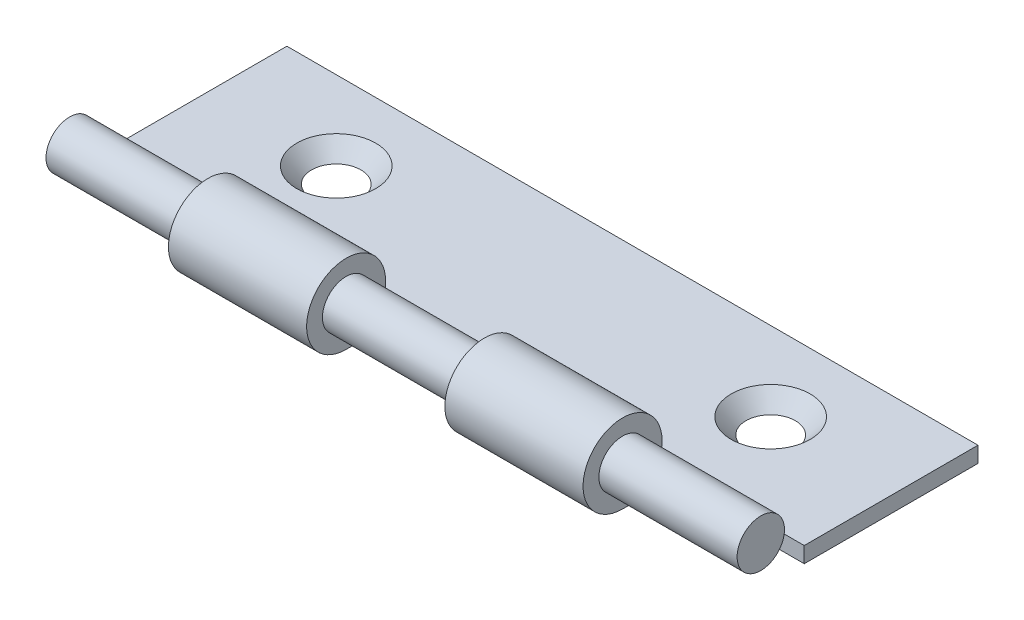
ISO-10303-21;
HEADER;
FILE_DESCRIPTION(('STEP AP214'),'2;1');
FILE_NAME('part.step','',(''),(''),'','','');
FILE_SCHEMA(('AUTOMOTIVE_DESIGN { 1 0 10303 214 1 1 1 1 }'));
ENDSEC;
DATA;
#1=APPLICATION_CONTEXT('core data for automotive mechanical design processes');
#2=APPLICATION_PROTOCOL_DEFINITION('international standard','automotive_design',2000,#1);
#3=PRODUCT_CONTEXT('',#1,'mechanical');
#4=PRODUCT('Part','Part','',(#3));
#5=PRODUCT_RELATED_PRODUCT_CATEGORY('part','',(#4));
#6=PRODUCT_DEFINITION_FORMATION('','',#4);
#7=PRODUCT_DEFINITION_CONTEXT('part definition',#1,'design');
#8=PRODUCT_DEFINITION('design','',#6,#7);
#9=PRODUCT_DEFINITION_SHAPE('','',#8);
#10=(LENGTH_UNIT() NAMED_UNIT(*) SI_UNIT(.MILLI.,.METRE.));
#11=(NAMED_UNIT(*) PLANE_ANGLE_UNIT() SI_UNIT($,.RADIAN.));
#12=(NAMED_UNIT(*) SI_UNIT($,.STERADIAN.) SOLID_ANGLE_UNIT());
#13=UNCERTAINTY_MEASURE_WITH_UNIT(LENGTH_MEASURE(1.E-05),#10,'distance_accuracy_value','');
#14=(GEOMETRIC_REPRESENTATION_CONTEXT(3) GLOBAL_UNCERTAINTY_ASSIGNED_CONTEXT((#13)) GLOBAL_UNIT_ASSIGNED_CONTEXT((#10,
#11,#12)) REPRESENTATION_CONTEXT('',''));
#15=CARTESIAN_POINT('',(0.,0.,0.));
#16=DIRECTION('',(0.,0.,1.));
#17=DIRECTION('',(1.,0.,0.));
#18=AXIS2_PLACEMENT_3D('',#15,#16,#17);
#19=CARTESIAN_POINT('',(35.,0.,0.));
#20=DIRECTION('',(-1.,0.,0.));
#21=DIRECTION('',(0.,0.,1.));
#22=AXIS2_PLACEMENT_3D('',#19,#20,#21);
#23=CYLINDRICAL_SURFACE('',#22,2.);
#24=CARTESIAN_POINT('',(28.,0.,0.));
#25=DIRECTION('',(-1.,0.,0.));
#26=DIRECTION('',(0.,0.,1.));
#27=AXIS2_PLACEMENT_3D('',#24,#25,#26);
#28=CIRCLE('',#27,2.);
#29=CARTESIAN_POINT('',(28.,-2.,0.));
#30=VERTEX_POINT('',#29);
#31=CARTESIAN_POINT('',(28.,-0.969619240492674,-1.74923941427879));
#32=VERTEX_POINT('',#31);
#33=EDGE_CURVE('E10',#30,#32,#28,.T.);
#34=ORIENTED_EDGE('',*,*,#33,.T.);
#35=DIRECTION('',(-1.,0.,0.));
#36=VECTOR('',#35,1.);
#37=CARTESIAN_POINT('',(35.,-0.969619240492674,-1.74923941427879));
#38=LINE('',#37,#36);
#39=CARTESIAN_POINT('',(21.,-0.969619240492674,-1.74923941427879));
#40=VERTEX_POINT('',#39);
#41=EDGE_CURVE('E296',#32,#40,#38,.T.);
#42=ORIENTED_EDGE('',*,*,#41,.T.);
#43=CARTESIAN_POINT('',(21.,0.,0.));
#44=DIRECTION('',(1.,0.,0.));
#45=DIRECTION('',(0.,0.,-1.));
#46=AXIS2_PLACEMENT_3D('',#43,#44,#45);
#47=CIRCLE('',#46,2.);
#48=CARTESIAN_POINT('',(21.,-2.,0.));
#49=VERTEX_POINT('',#48);
#50=EDGE_CURVE('E227',#40,#49,#47,.T.);
#51=ORIENTED_EDGE('',*,*,#50,.T.);
#52=DIRECTION('',(-1.,0.,0.));
#53=VECTOR('',#52,1.);
#54=CARTESIAN_POINT('',(35.,-2.,0.));
#55=LINE('',#54,#53);
#56=EDGE_CURVE('E177',#30,#49,#55,.T.);
#57=ORIENTED_EDGE('',*,*,#56,.F.);
#58=EDGE_LOOP('',(#34,#42,#51,#57));
#59=FACE_BOUND('',#58,.T.);
#60=ADVANCED_FACE('F15',(#59),#23,.T.);
#61=CARTESIAN_POINT('',(14.,0.,0.));
#62=DIRECTION('',(-1.,0.,0.));
#63=DIRECTION('',(0.,0.,1.));
#64=AXIS2_PLACEMENT_3D('',#61,#62,#63);
#65=CIRCLE('',#64,2.);
#66=CARTESIAN_POINT('',(14.,-2.,0.));
#67=VERTEX_POINT('',#66);
#68=CARTESIAN_POINT('',(14.,-0.969619240492674,-1.74923941427879));
#69=VERTEX_POINT('',#68);
#70=EDGE_CURVE('E214',#67,#69,#65,.T.);
#71=ORIENTED_EDGE('',*,*,#70,.T.);
#72=CARTESIAN_POINT('',(7.,-0.969619240492674,-1.74923941427879));
#73=VERTEX_POINT('',#72);
#74=EDGE_CURVE('E295',#69,#73,#38,.T.);
#75=ORIENTED_EDGE('',*,*,#74,.T.);
#76=CARTESIAN_POINT('',(7.,0.,0.));
#77=DIRECTION('',(1.,0.,0.));
#78=DIRECTION('',(0.,0.,-1.));
#79=AXIS2_PLACEMENT_3D('',#76,#77,#78);
#80=CIRCLE('',#79,2.);
#81=CARTESIAN_POINT('',(7.,-2.,0.));
#82=VERTEX_POINT('',#81);
#83=EDGE_CURVE('E254',#73,#82,#80,.T.);
#84=ORIENTED_EDGE('',*,*,#83,.T.);
#85=EDGE_CURVE('E176',#67,#82,#55,.T.);
#86=ORIENTED_EDGE('',*,*,#85,.F.);
#87=EDGE_LOOP('',(#71,#75,#84,#86));
#88=FACE_BOUND('',#87,.T.);
#89=ADVANCED_FACE('F308',(#88),#23,.T.);
#90=CARTESIAN_POINT('',(35.,-0.581771544295604,-1.04954364856727));
#91=DIRECTION('',(0.,0.874619707139396,-0.484809620246337));
#92=DIRECTION('',(0.,0.484809620246337,0.874619707139396));
#93=AXIS2_PLACEMENT_3D('',#90,#91,#92);
#94=PLANE('',#93);
#95=ORIENTED_EDGE('',*,*,#41,.F.);
#96=DIRECTION('',(0.,0.484809620246337,0.874619707139396));
#97=VECTOR('',#96,1.);
#98=CARTESIAN_POINT('',(28.,-0.581771544295604,-1.04954364856727));
#99=LINE('',#98,#97);
#100=CARTESIAN_POINT('',(28.,-0.581771544295604,-1.04954364856727));
#101=VERTEX_POINT('',#100);
#102=EDGE_CURVE('E141',#32,#101,#99,.T.);
#103=ORIENTED_EDGE('',*,*,#102,.T.);
#104=DIRECTION('',(-1.,0.,0.));
#105=VECTOR('',#104,1.);
#106=CARTESIAN_POINT('',(35.,-0.581771544295604,-1.04954364856727));
#107=LINE('',#106,#105);
#108=CARTESIAN_POINT('',(21.,-0.581771544295604,-1.04954364856727));
#109=VERTEX_POINT('',#108);
#110=EDGE_CURVE('E135',#101,#109,#107,.T.);
#111=ORIENTED_EDGE('',*,*,#110,.T.);
#112=DIRECTION('',(0.,-0.484809620246337,-0.874619707139396));
#113=VECTOR('',#112,1.);
#114=CARTESIAN_POINT('',(21.,-0.581771544295604,-1.04954364856727));
#115=LINE('',#114,#113);
#116=EDGE_CURVE('E188',#109,#40,#115,.T.);
#117=ORIENTED_EDGE('',*,*,#116,.T.);
#118=EDGE_LOOP('',(#95,#103,#111,#117));
#119=FACE_BOUND('',#118,.T.);
#120=ADVANCED_FACE('F377',(#119),#94,.F.);
#121=CARTESIAN_POINT('',(35.,-2.,0.));
#122=DIRECTION('',(0.,1.,0.));
#123=DIRECTION('',(1.,0.,0.));
#124=AXIS2_PLACEMENT_3D('',#121,#122,#123);
#125=PLANE('',#124);
#126=DIRECTION('',(1.,0.,0.));
#127=VECTOR('',#126,1.);
#128=CARTESIAN_POINT('',(28.,-2.,-2.2));
#129=LINE('',#128,#127);
#130=CARTESIAN_POINT('',(28.,-2.,-2.2));
#131=VERTEX_POINT('',#130);
#132=CARTESIAN_POINT('',(35.,-2.,-2.2));
#133=VERTEX_POINT('',#132);
#134=EDGE_CURVE('E30',#131,#133,#129,.T.);
#135=ORIENTED_EDGE('',*,*,#134,.F.);
#136=DIRECTION('',(0.,0.,-1.));
#137=VECTOR('',#136,1.);
#138=CARTESIAN_POINT('',(28.,-2.,-0.1));
#139=LINE('',#138,#137);
#140=EDGE_CURVE('E341',#30,#131,#139,.T.);
#141=ORIENTED_EDGE('',*,*,#140,.F.);
#142=ORIENTED_EDGE('',*,*,#56,.T.);
#143=DIRECTION('',(0.,0.,1.));
#144=VECTOR('',#143,1.);
#145=CARTESIAN_POINT('',(21.,-2.,-0.1));
#146=LINE('',#145,#144);
#147=CARTESIAN_POINT('',(21.,-2.,-2.2));
#148=VERTEX_POINT('',#147);
#149=EDGE_CURVE('E222',#148,#49,#146,.T.);
#150=ORIENTED_EDGE('',*,*,#149,.F.);
#151=DIRECTION('',(1.,0.,0.));
#152=VECTOR('',#151,1.);
#153=CARTESIAN_POINT('',(14.,-2.,-2.2));
#154=LINE('',#153,#152);
#155=CARTESIAN_POINT('',(14.,-2.,-2.2));
#156=VERTEX_POINT('',#155);
#157=EDGE_CURVE('E211',#156,#148,#154,.T.);
#158=ORIENTED_EDGE('',*,*,#157,.F.);
#159=DIRECTION('',(0.,0.,-1.));
#160=VECTOR('',#159,1.);
#161=CARTESIAN_POINT('',(14.,-2.,-0.1));
#162=LINE('',#161,#160);
#163=EDGE_CURVE('E150',#67,#156,#162,.T.);
#164=ORIENTED_EDGE('',*,*,#163,.F.);
#165=ORIENTED_EDGE('',*,*,#85,.T.);
#166=DIRECTION('',(0.,0.,1.));
#167=VECTOR('',#166,1.);
#168=CARTESIAN_POINT('',(7.,-2.,-0.1));
#169=LINE('',#168,#167);
#170=CARTESIAN_POINT('',(7.,-2.,-2.2));
#171=VERTEX_POINT('',#170);
#172=EDGE_CURVE('E243',#171,#82,#169,.T.);
#173=ORIENTED_EDGE('',*,*,#172,.F.);
#174=DIRECTION('',(1.,0.,0.));
#175=VECTOR('',#174,1.);
#176=CARTESIAN_POINT('',(0.,-2.,-2.2));
#177=LINE('',#176,#175);
#178=CARTESIAN_POINT('',(0.,-2.,-2.2));
#179=VERTEX_POINT('',#178);
#180=EDGE_CURVE('E236',#179,#171,#177,.T.);
#181=ORIENTED_EDGE('',*,*,#180,.F.);
#182=DIRECTION('',(0.,0.,-1.));
#183=VECTOR('',#182,1.);
#184=CARTESIAN_POINT('',(0.,-2.,0.));
#185=LINE('',#184,#183);
#186=CARTESIAN_POINT('',(0.,-2.,-11.));
#187=VERTEX_POINT('',#186);
#188=EDGE_CURVE('E276',#179,#187,#185,.T.);
#189=ORIENTED_EDGE('',*,*,#188,.T.);
#190=DIRECTION('',(-1.,0.,0.));
#191=VECTOR('',#190,1.);
#192=CARTESIAN_POINT('',(35.,-2.,-11.));
#193=LINE('',#192,#191);
#194=CARTESIAN_POINT('',(35.,-2.,-11.));
#195=VERTEX_POINT('',#194);
#196=EDGE_CURVE('E167',#195,#187,#193,.T.);
#197=ORIENTED_EDGE('',*,*,#196,.F.);
#198=DIRECTION('',(0.,0.,-1.));
#199=VECTOR('',#198,1.);
#200=CARTESIAN_POINT('',(35.,-2.,0.));
#201=LINE('',#200,#199);
#202=EDGE_CURVE('E286',#133,#195,#201,.T.);
#203=ORIENTED_EDGE('',*,*,#202,.F.);
#204=EDGE_LOOP('',(#135,#141,#142,#150,#158,#164,#165,#173,#181,#189,#197,#203));
#205=FACE_BOUND('',#204,.T.);
#206=CARTESIAN_POINT('',(6.5,-2.,-7.));
#207=DIRECTION('',(0.,-1.,0.));
#208=DIRECTION('',(1.,0.,0.));
#209=AXIS2_PLACEMENT_3D('',#206,#207,#208);
#210=CIRCLE('',#209,1.25);
#211=CARTESIAN_POINT('',(7.75,-2.,-7.));
#212=VERTEX_POINT('',#211);
#213=EDGE_CURVE('E269',#212,#212,#210,.T.);
#214=ORIENTED_EDGE('',*,*,#213,.F.);
#215=EDGE_LOOP('',(#214));
#216=FACE_BOUND('',#215,.T.);
#217=CARTESIAN_POINT('',(28.5,-2.,-7.));
#218=DIRECTION('',(0.,-1.,0.));
#219=DIRECTION('',(1.,0.,0.));
#220=AXIS2_PLACEMENT_3D('',#217,#218,#219);
#221=CIRCLE('',#220,1.25);
#222=CARTESIAN_POINT('',(29.75,-2.,-7.));
#223=VERTEX_POINT('',#222);
#224=EDGE_CURVE('E261',#223,#223,#221,.T.);
#225=ORIENTED_EDGE('',*,*,#224,.F.);
#226=EDGE_LOOP('',(#225));
#227=FACE_BOUND('',#226,.T.);
#228=ADVANCED_FACE('F329',(#205,#216,#227),#125,.F.);
#229=CARTESIAN_POINT('',(35.,-1.2,0.));
#230=DIRECTION('',(0.,1.,0.));
#231=DIRECTION('',(1.,0.,0.));
#232=AXIS2_PLACEMENT_3D('',#229,#230,#231);
#233=PLANE('',#232);
#234=DIRECTION('',(0.,0.,1.));
#235=VECTOR('',#234,1.);
#236=CARTESIAN_POINT('',(28.,-1.2,0.));
#237=LINE('',#236,#235);
#238=CARTESIAN_POINT('',(28.,-1.2,-2.2));
#239=VERTEX_POINT('',#238);
#240=CARTESIAN_POINT('',(28.,-1.2,0.));
#241=VERTEX_POINT('',#240);
#242=EDGE_CURVE('E140',#239,#241,#237,.T.);
#243=ORIENTED_EDGE('',*,*,#242,.F.);
#244=DIRECTION('',(-1.,0.,0.));
#245=VECTOR('',#244,1.);
#246=CARTESIAN_POINT('',(35.,-1.2,-2.2));
#247=LINE('',#246,#245);
#248=CARTESIAN_POINT('',(35.,-1.2,-2.2));
#249=VERTEX_POINT('',#248);
#250=EDGE_CURVE('E349',#249,#239,#247,.T.);
#251=ORIENTED_EDGE('',*,*,#250,.F.);
#252=DIRECTION('',(0.,0.,-1.));
#253=VECTOR('',#252,1.);
#254=CARTESIAN_POINT('',(35.,-1.2,0.));
#255=LINE('',#254,#253);
#256=CARTESIAN_POINT('',(35.,-1.2,-11.));
#257=VERTEX_POINT('',#256);
#258=EDGE_CURVE('E293',#249,#257,#255,.T.);
#259=ORIENTED_EDGE('',*,*,#258,.T.);
#260=DIRECTION('',(-1.,0.,0.));
#261=VECTOR('',#260,1.);
#262=CARTESIAN_POINT('',(35.,-1.2,-11.));
#263=LINE('',#262,#261);
#264=CARTESIAN_POINT('',(0.,-1.2,-11.));
#265=VERTEX_POINT('',#264);
#266=EDGE_CURVE('E158',#257,#265,#263,.T.);
#267=ORIENTED_EDGE('',*,*,#266,.T.);
#268=DIRECTION('',(0.,0.,-1.));
#269=VECTOR('',#268,1.);
#270=CARTESIAN_POINT('',(0.,-1.2,0.));
#271=LINE('',#270,#269);
#272=CARTESIAN_POINT('',(0.,-1.2,-2.2));
#273=VERTEX_POINT('',#272);
#274=EDGE_CURVE('E283',#273,#265,#271,.T.);
#275=ORIENTED_EDGE('',*,*,#274,.F.);
#276=DIRECTION('',(-1.,0.,0.));
#277=VECTOR('',#276,1.);
#278=CARTESIAN_POINT('',(35.,-1.2,-2.2));
#279=LINE('',#278,#277);
#280=CARTESIAN_POINT('',(7.,-1.2,-2.2));
#281=VERTEX_POINT('',#280);
#282=EDGE_CURVE('E247',#281,#273,#279,.T.);
#283=ORIENTED_EDGE('',*,*,#282,.F.);
#284=DIRECTION('',(0.,0.,-1.));
#285=VECTOR('',#284,1.);
#286=CARTESIAN_POINT('',(7.,-1.2,0.));
#287=LINE('',#286,#285);
#288=CARTESIAN_POINT('',(7.,-1.2,0.));
#289=VERTEX_POINT('',#288);
#290=EDGE_CURVE('E258',#289,#281,#287,.T.);
#291=ORIENTED_EDGE('',*,*,#290,.F.);
#292=DIRECTION('',(-1.,0.,0.));
#293=VECTOR('',#292,1.);
#294=CARTESIAN_POINT('',(35.,-1.2,0.));
#295=LINE('',#294,#293);
#296=CARTESIAN_POINT('',(14.,-1.2,0.));
#297=VERTEX_POINT('',#296);
#298=EDGE_CURVE('E159',#297,#289,#295,.T.);
#299=ORIENTED_EDGE('',*,*,#298,.F.);
#300=DIRECTION('',(0.,0.,1.));
#301=VECTOR('',#300,1.);
#302=CARTESIAN_POINT('',(14.,-1.2,0.));
#303=LINE('',#302,#301);
#304=CARTESIAN_POINT('',(14.,-1.2,-2.2));
#305=VERTEX_POINT('',#304);
#306=EDGE_CURVE('E207',#305,#297,#303,.T.);
#307=ORIENTED_EDGE('',*,*,#306,.F.);
#308=DIRECTION('',(-1.,0.,0.));
#309=VECTOR('',#308,1.);
#310=CARTESIAN_POINT('',(35.,-1.2,-2.2));
#311=LINE('',#310,#309);
#312=CARTESIAN_POINT('',(21.,-1.2,-2.2));
#313=VERTEX_POINT('',#312);
#314=EDGE_CURVE('E23',#313,#305,#311,.T.);
#315=ORIENTED_EDGE('',*,*,#314,.F.);
#316=DIRECTION('',(0.,0.,-1.));
#317=VECTOR('',#316,1.);
#318=CARTESIAN_POINT('',(21.,-1.2,0.));
#319=LINE('',#318,#317);
#320=CARTESIAN_POINT('',(21.,-1.2,0.));
#321=VERTEX_POINT('',#320);
#322=EDGE_CURVE('E156',#321,#313,#319,.T.);
#323=ORIENTED_EDGE('',*,*,#322,.F.);
#324=EDGE_CURVE('E132',#241,#321,#295,.T.);
#325=ORIENTED_EDGE('',*,*,#324,.F.);
#326=EDGE_LOOP('',(#243,#251,#259,#267,#275,#283,#291,#299,#307,#315,#323,#325));
#327=FACE_BOUND('',#326,.T.);
#328=CARTESIAN_POINT('',(6.5,-1.2,-7.));
#329=DIRECTION('',(0.,-1.,0.));
#330=DIRECTION('',(1.,0.,0.));
#331=AXIS2_PLACEMENT_3D('',#328,#329,#330);
#332=CIRCLE('',#331,2.);
#333=CARTESIAN_POINT('',(8.5,-1.2,-7.));
#334=VERTEX_POINT('',#333);
#335=EDGE_CURVE('E273',#334,#334,#332,.T.);
#336=ORIENTED_EDGE('',*,*,#335,.T.);
#337=EDGE_LOOP('',(#336));
#338=FACE_BOUND('',#337,.T.);
#339=CARTESIAN_POINT('',(28.5,-1.2,-7.));
#340=DIRECTION('',(0.,-1.,0.));
#341=DIRECTION('',(1.,0.,0.));
#342=AXIS2_PLACEMENT_3D('',#339,#340,#341);
#343=CIRCLE('',#342,2.);
#344=CARTESIAN_POINT('',(30.5,-1.2,-7.));
#345=VERTEX_POINT('',#344);
#346=EDGE_CURVE('E265',#345,#345,#343,.T.);
#347=ORIENTED_EDGE('',*,*,#346,.T.);
#348=EDGE_LOOP('',(#347));
#349=FACE_BOUND('',#348,.T.);
#350=ADVANCED_FACE('F153',(#327,#338,#349),#233,.T.);
#351=CARTESIAN_POINT('',(35.,-1.2,-11.));
#352=DIRECTION('',(0.,0.,-1.));
#353=DIRECTION('',(-1.,0.,0.));
#354=AXIS2_PLACEMENT_3D('',#351,#352,#353);
#355=PLANE('',#354);
#356=DIRECTION('',(0.,-1.,0.));
#357=VECTOR('',#356,1.);
#358=CARTESIAN_POINT('',(0.,-1.2,-11.));
#359=LINE('',#358,#357);
#360=EDGE_CURVE('E279',#265,#187,#359,.T.);
#361=ORIENTED_EDGE('',*,*,#360,.F.);
#362=ORIENTED_EDGE('',*,*,#266,.F.);
#363=DIRECTION('',(0.,-1.,0.));
#364=VECTOR('',#363,1.);
#365=CARTESIAN_POINT('',(35.,-1.2,-11.));
#366=LINE('',#365,#364);
#367=EDGE_CURVE('E289',#257,#195,#366,.T.);
#368=ORIENTED_EDGE('',*,*,#367,.T.);
#369=ORIENTED_EDGE('',*,*,#196,.T.);
#370=EDGE_LOOP('',(#361,#362,#368,#369));
#371=FACE_BOUND('',#370,.T.);
#372=ADVANCED_FACE('F333',(#371),#355,.T.);
#373=ORIENTED_EDGE('',*,*,#74,.F.);
#374=DIRECTION('',(0.,0.484809620246337,0.874619707139396));
#375=VECTOR('',#374,1.);
#376=CARTESIAN_POINT('',(14.,-0.581771544295604,-1.04954364856727));
#377=LINE('',#376,#375);
#378=CARTESIAN_POINT('',(14.,-0.581771544295604,-1.04954364856727));
#379=VERTEX_POINT('',#378);
#380=EDGE_CURVE('E184',#69,#379,#377,.T.);
#381=ORIENTED_EDGE('',*,*,#380,.T.);
#382=CARTESIAN_POINT('',(7.,-0.581771544295604,-1.04954364856727));
#383=VERTEX_POINT('',#382);
#384=EDGE_CURVE('E38',#379,#383,#107,.T.);
#385=ORIENTED_EDGE('',*,*,#384,.T.);
#386=DIRECTION('',(0.,-0.484809620246337,-0.874619707139396));
#387=VECTOR('',#386,1.);
#388=CARTESIAN_POINT('',(7.,-0.581771544295604,-1.04954364856727));
#389=LINE('',#388,#387);
#390=EDGE_CURVE('E180',#383,#73,#389,.T.);
#391=ORIENTED_EDGE('',*,*,#390,.T.);
#392=EDGE_LOOP('',(#373,#381,#385,#391));
#393=FACE_BOUND('',#392,.T.);
#394=ADVANCED_FACE('F316',(#393),#94,.F.);
#395=CARTESIAN_POINT('',(35.,0.,0.));
#396=DIRECTION('',(1.,0.,0.));
#397=DIRECTION('',(0.,0.,-1.));
#398=AXIS2_PLACEMENT_3D('',#395,#396,#397);
#399=PLANE('',#398);
#400=DIRECTION('',(0.,-1.,0.));
#401=VECTOR('',#400,1.);
#402=CARTESIAN_POINT('',(35.,0.,-2.2));
#403=LINE('',#402,#401);
#404=EDGE_CURVE('E339',#249,#133,#403,.T.);
#405=ORIENTED_EDGE('',*,*,#404,.T.);
#406=ORIENTED_EDGE('',*,*,#202,.T.);
#407=ORIENTED_EDGE('',*,*,#367,.F.);
#408=ORIENTED_EDGE('',*,*,#258,.F.);
#409=EDGE_LOOP('',(#405,#406,#407,#408));
#410=FACE_BOUND('',#409,.T.);
#411=ADVANCED_FACE('F338',(#410),#399,.T.);
#412=CARTESIAN_POINT('',(0.,0.,0.));
#413=DIRECTION('',(1.,0.,0.));
#414=DIRECTION('',(0.,0.,-1.));
#415=AXIS2_PLACEMENT_3D('',#412,#413,#414);
#416=PLANE('',#415);
#417=ORIENTED_EDGE('',*,*,#188,.F.);
#418=DIRECTION('',(0.,1.,0.));
#419=VECTOR('',#418,1.);
#420=CARTESIAN_POINT('',(0.,0.,-2.2));
#421=LINE('',#420,#419);
#422=EDGE_CURVE('E232',#179,#273,#421,.T.);
#423=ORIENTED_EDGE('',*,*,#422,.T.);
#424=ORIENTED_EDGE('',*,*,#274,.T.);
#425=ORIENTED_EDGE('',*,*,#360,.T.);
#426=EDGE_LOOP('',(#417,#423,#424,#425));
#427=FACE_BOUND('',#426,.T.);
#428=ADVANCED_FACE('F325',(#427),#416,.F.);
#429=CARTESIAN_POINT('',(6.5,-1.2,-7.));
#430=DIRECTION('',(0.,1.,0.));
#431=DIRECTION('',(-1.,0.,0.));
#432=AXIS2_PLACEMENT_3D('',#429,#430,#431);
#433=CONICAL_SURFACE('',#432,2.,0.753151280962195);
#434=ORIENTED_EDGE('',*,*,#213,.T.);
#435=EDGE_LOOP('',(#434));
#436=FACE_BOUND('',#435,.T.);
#437=ORIENTED_EDGE('',*,*,#335,.F.);
#438=EDGE_LOOP('',(#437));
#439=FACE_BOUND('',#438,.T.);
#440=ADVANCED_FACE('F461',(#436,#439),#433,.F.);
#441=CARTESIAN_POINT('',(28.5,-1.2,-7.));
#442=DIRECTION('',(0.,1.,0.));
#443=DIRECTION('',(-1.,0.,0.));
#444=AXIS2_PLACEMENT_3D('',#441,#442,#443);
#445=CONICAL_SURFACE('',#444,2.,0.753151280962195);
#446=ORIENTED_EDGE('',*,*,#224,.T.);
#447=EDGE_LOOP('',(#446));
#448=FACE_BOUND('',#447,.T.);
#449=ORIENTED_EDGE('',*,*,#346,.F.);
#450=EDGE_LOOP('',(#449));
#451=FACE_BOUND('',#450,.T.);
#452=ADVANCED_FACE('F458',(#448,#451),#445,.F.);
#453=CARTESIAN_POINT('',(7.,0.,-0.1));
#454=DIRECTION('',(1.,0.,0.));
#455=DIRECTION('',(0.,0.,-1.));
#456=AXIS2_PLACEMENT_3D('',#453,#454,#455);
#457=PLANE('',#456);
#458=ORIENTED_EDGE('',*,*,#83,.F.);
#459=ORIENTED_EDGE('',*,*,#390,.F.);
#460=CARTESIAN_POINT('',(7.,0.,0.));
#461=DIRECTION('',(1.,0.,0.));
#462=DIRECTION('',(0.,0.,-1.));
#463=AXIS2_PLACEMENT_3D('',#460,#461,#462);
#464=CIRCLE('',#463,1.2);
#465=EDGE_CURVE('E250',#383,#289,#464,.T.);
#466=ORIENTED_EDGE('',*,*,#465,.T.);
#467=ORIENTED_EDGE('',*,*,#290,.T.);
#468=DIRECTION('',(0.,-1.,0.));
#469=VECTOR('',#468,1.);
#470=CARTESIAN_POINT('',(7.,0.,-2.2));
#471=LINE('',#470,#469);
#472=EDGE_CURVE('E240',#281,#171,#471,.T.);
#473=ORIENTED_EDGE('',*,*,#472,.T.);
#474=ORIENTED_EDGE('',*,*,#172,.T.);
#475=EDGE_LOOP('',(#458,#459,#466,#467,#473,#474));
#476=FACE_BOUND('',#475,.T.);
#477=ADVANCED_FACE('F314',(#476),#457,.F.);
#478=CARTESIAN_POINT('',(0.,0.,-2.2));
#479=DIRECTION('',(0.,0.,-1.));
#480=DIRECTION('',(-1.,0.,0.));
#481=AXIS2_PLACEMENT_3D('',#478,#479,#480);
#482=PLANE('',#481);
#483=ORIENTED_EDGE('',*,*,#282,.T.);
#484=ORIENTED_EDGE('',*,*,#422,.F.);
#485=ORIENTED_EDGE('',*,*,#180,.T.);
#486=ORIENTED_EDGE('',*,*,#472,.F.);
#487=EDGE_LOOP('',(#483,#484,#485,#486));
#488=FACE_BOUND('',#487,.T.);
#489=ADVANCED_FACE('F321',(#488),#482,.F.);
#490=CARTESIAN_POINT('',(21.,0.,-0.1));
#491=DIRECTION('',(1.,0.,0.));
#492=DIRECTION('',(0.,0.,-1.));
#493=AXIS2_PLACEMENT_3D('',#490,#491,#492);
#494=PLANE('',#493);
#495=ORIENTED_EDGE('',*,*,#50,.F.);
#496=ORIENTED_EDGE('',*,*,#116,.F.);
#497=CARTESIAN_POINT('',(21.,0.,0.));
#498=DIRECTION('',(1.,0.,0.));
#499=DIRECTION('',(0.,0.,-1.));
#500=AXIS2_PLACEMENT_3D('',#497,#498,#499);
#501=CIRCLE('',#500,1.2);
#502=EDGE_CURVE('E219',#109,#321,#501,.T.);
#503=ORIENTED_EDGE('',*,*,#502,.T.);
#504=ORIENTED_EDGE('',*,*,#322,.T.);
#505=DIRECTION('',(0.,-1.,0.));
#506=VECTOR('',#505,1.);
#507=CARTESIAN_POINT('',(21.,0.,-2.2));
#508=LINE('',#507,#506);
#509=EDGE_CURVE('E202',#313,#148,#508,.T.);
#510=ORIENTED_EDGE('',*,*,#509,.T.);
#511=ORIENTED_EDGE('',*,*,#149,.T.);
#512=EDGE_LOOP('',(#495,#496,#503,#504,#510,#511));
#513=FACE_BOUND('',#512,.T.);
#514=ADVANCED_FACE('F370',(#513),#494,.F.);
#515=CARTESIAN_POINT('',(14.,0.,-0.1));
#516=DIRECTION('',(-1.,0.,0.));
#517=DIRECTION('',(0.,0.,1.));
#518=AXIS2_PLACEMENT_3D('',#515,#516,#517);
#519=PLANE('',#518);
#520=ORIENTED_EDGE('',*,*,#163,.T.);
#521=DIRECTION('',(0.,1.,0.));
#522=VECTOR('',#521,1.);
#523=CARTESIAN_POINT('',(14.,0.,-2.2));
#524=LINE('',#523,#522);
#525=EDGE_CURVE('E200',#156,#305,#524,.T.);
#526=ORIENTED_EDGE('',*,*,#525,.T.);
#527=ORIENTED_EDGE('',*,*,#306,.T.);
#528=CARTESIAN_POINT('',(14.,0.,0.));
#529=DIRECTION('',(-1.,0.,0.));
#530=DIRECTION('',(0.,0.,1.));
#531=AXIS2_PLACEMENT_3D('',#528,#529,#530);
#532=CIRCLE('',#531,1.2);
#533=EDGE_CURVE('E215',#297,#379,#532,.T.);
#534=ORIENTED_EDGE('',*,*,#533,.T.);
#535=ORIENTED_EDGE('',*,*,#380,.F.);
#536=ORIENTED_EDGE('',*,*,#70,.F.);
#537=EDGE_LOOP('',(#520,#526,#527,#534,#535,#536));
#538=FACE_BOUND('',#537,.T.);
#539=ADVANCED_FACE('F206',(#538),#519,.F.);
#540=CARTESIAN_POINT('',(14.,0.,-2.2));
#541=DIRECTION('',(0.,0.,-1.));
#542=DIRECTION('',(-1.,0.,0.));
#543=AXIS2_PLACEMENT_3D('',#540,#541,#542);
#544=PLANE('',#543);
#545=ORIENTED_EDGE('',*,*,#314,.T.);
#546=ORIENTED_EDGE('',*,*,#525,.F.);
#547=ORIENTED_EDGE('',*,*,#157,.T.);
#548=ORIENTED_EDGE('',*,*,#509,.F.);
#549=EDGE_LOOP('',(#545,#546,#547,#548));
#550=FACE_BOUND('',#549,.T.);
#551=ADVANCED_FACE('F198',(#550),#544,.F.);
#552=CARTESIAN_POINT('',(28.,0.,-0.1));
#553=DIRECTION('',(-1.,0.,0.));
#554=DIRECTION('',(0.,0.,1.));
#555=AXIS2_PLACEMENT_3D('',#552,#553,#554);
#556=PLANE('',#555);
#557=ORIENTED_EDGE('',*,*,#242,.T.);
#558=CARTESIAN_POINT('',(28.,0.,0.));
#559=DIRECTION('',(-1.,0.,0.));
#560=DIRECTION('',(0.,0.,1.));
#561=AXIS2_PLACEMENT_3D('',#558,#559,#560);
#562=CIRCLE('',#561,1.2);
#563=EDGE_CURVE('E127',#241,#101,#562,.T.);
#564=ORIENTED_EDGE('',*,*,#563,.T.);
#565=ORIENTED_EDGE('',*,*,#102,.F.);
#566=ORIENTED_EDGE('',*,*,#33,.F.);
#567=ORIENTED_EDGE('',*,*,#140,.T.);
#568=DIRECTION('',(0.,1.,0.));
#569=VECTOR('',#568,1.);
#570=CARTESIAN_POINT('',(28.,0.,-2.2));
#571=LINE('',#570,#569);
#572=EDGE_CURVE('E146',#131,#239,#571,.T.);
#573=ORIENTED_EDGE('',*,*,#572,.T.);
#574=EDGE_LOOP('',(#557,#564,#565,#566,#567,#573));
#575=FACE_BOUND('',#574,.T.);
#576=ADVANCED_FACE('F145',(#575),#556,.F.);
#577=CARTESIAN_POINT('',(28.,0.,-2.2));
#578=DIRECTION('',(0.,0.,-1.));
#579=DIRECTION('',(-1.,0.,0.));
#580=AXIS2_PLACEMENT_3D('',#577,#578,#579);
#581=PLANE('',#580);
#582=ORIENTED_EDGE('',*,*,#250,.T.);
#583=ORIENTED_EDGE('',*,*,#572,.F.);
#584=ORIENTED_EDGE('',*,*,#134,.T.);
#585=ORIENTED_EDGE('',*,*,#404,.F.);
#586=EDGE_LOOP('',(#582,#583,#584,#585));
#587=FACE_BOUND('',#586,.T.);
#588=ADVANCED_FACE('F437',(#587),#581,.F.);
#589=CARTESIAN_POINT('',(0.,0.,0.));
#590=DIRECTION('',(1.,0.,0.));
#591=DIRECTION('',(0.,1.,0.));
#592=AXIS2_PLACEMENT_3D('',#589,#590,#591);
#593=CYLINDRICAL_SURFACE('',#592,1.2);
#594=ORIENTED_EDGE('',*,*,#502,.F.);
#595=ORIENTED_EDGE('',*,*,#110,.F.);
#596=ORIENTED_EDGE('',*,*,#563,.F.);
#597=ORIENTED_EDGE('',*,*,#324,.T.);
#598=EDGE_LOOP('',(#594,#595,#596,#597));
#599=FACE_BOUND('',#598,.T.);
#600=CARTESIAN_POINT('',(35.,0.,0.));
#601=DIRECTION('',(-1.,0.,0.));
#602=DIRECTION('',(0.,1.,0.));
#603=AXIS2_PLACEMENT_3D('',#600,#601,#602);
#604=CIRCLE('',#603,1.2);
#605=CARTESIAN_POINT('',(35.,1.2,0.));
#606=VERTEX_POINT('',#605);
#607=EDGE_CURVE('E436',#606,#606,#604,.T.);
#608=ORIENTED_EDGE('',*,*,#607,.T.);
#609=EDGE_LOOP('',(#608));
#610=FACE_BOUND('',#609,.T.);
#611=CARTESIAN_POINT('',(0.,0.,0.));
#612=DIRECTION('',(1.,0.,0.));
#613=DIRECTION('',(0.,1.,0.));
#614=AXIS2_PLACEMENT_3D('',#611,#612,#613);
#615=CIRCLE('',#614,1.2);
#616=CARTESIAN_POINT('',(0.,1.2,0.));
#617=VERTEX_POINT('',#616);
#618=EDGE_CURVE('E548',#617,#617,#615,.T.);
#619=ORIENTED_EDGE('',*,*,#618,.T.);
#620=EDGE_LOOP('',(#619));
#621=FACE_BOUND('',#620,.T.);
#622=ORIENTED_EDGE('',*,*,#465,.F.);
#623=ORIENTED_EDGE('',*,*,#384,.F.);
#624=ORIENTED_EDGE('',*,*,#533,.F.);
#625=ORIENTED_EDGE('',*,*,#298,.T.);
#626=EDGE_LOOP('',(#622,#623,#624,#625));
#627=FACE_BOUND('',#626,.T.);
#628=ADVANCED_FACE('F129',(#599,#610,#621,#627),#593,.T.);
#629=CARTESIAN_POINT('',(35.,0.,0.));
#630=DIRECTION('',(1.,0.,0.));
#631=DIRECTION('',(0.,0.,-1.));
#632=AXIS2_PLACEMENT_3D('',#629,#630,#631);
#633=PLANE('',#632);
#634=ORIENTED_EDGE('',*,*,#607,.F.);
#635=EDGE_LOOP('',(#634));
#636=FACE_BOUND('',#635,.T.);
#637=ADVANCED_FACE('F444',(#636),#633,.T.);
#638=CARTESIAN_POINT('',(0.,0.,0.));
#639=DIRECTION('',(-1.,0.,0.));
#640=DIRECTION('',(0.,0.,1.));
#641=AXIS2_PLACEMENT_3D('',#638,#639,#640);
#642=PLANE('',#641);
#643=ORIENTED_EDGE('',*,*,#618,.F.);
#644=EDGE_LOOP('',(#643));
#645=FACE_BOUND('',#644,.T.);
#646=ADVANCED_FACE('F532',(#645),#642,.T.);
#647=CLOSED_SHELL('',(#60,#89,#120,#228,#350,#372,#394,#411,#428,#440,#452,#477,#489,#514,#539,
#551,#576,#588,#628,#637,#646));
#648=MANIFOLD_SOLID_BREP('B1',#647);
#649=ADVANCED_BREP_SHAPE_REPRESENTATION('',(#18,#648),#14);
#650=SHAPE_DEFINITION_REPRESENTATION(#9,#649);
ENDSEC;
END-ISO-10303-21;
